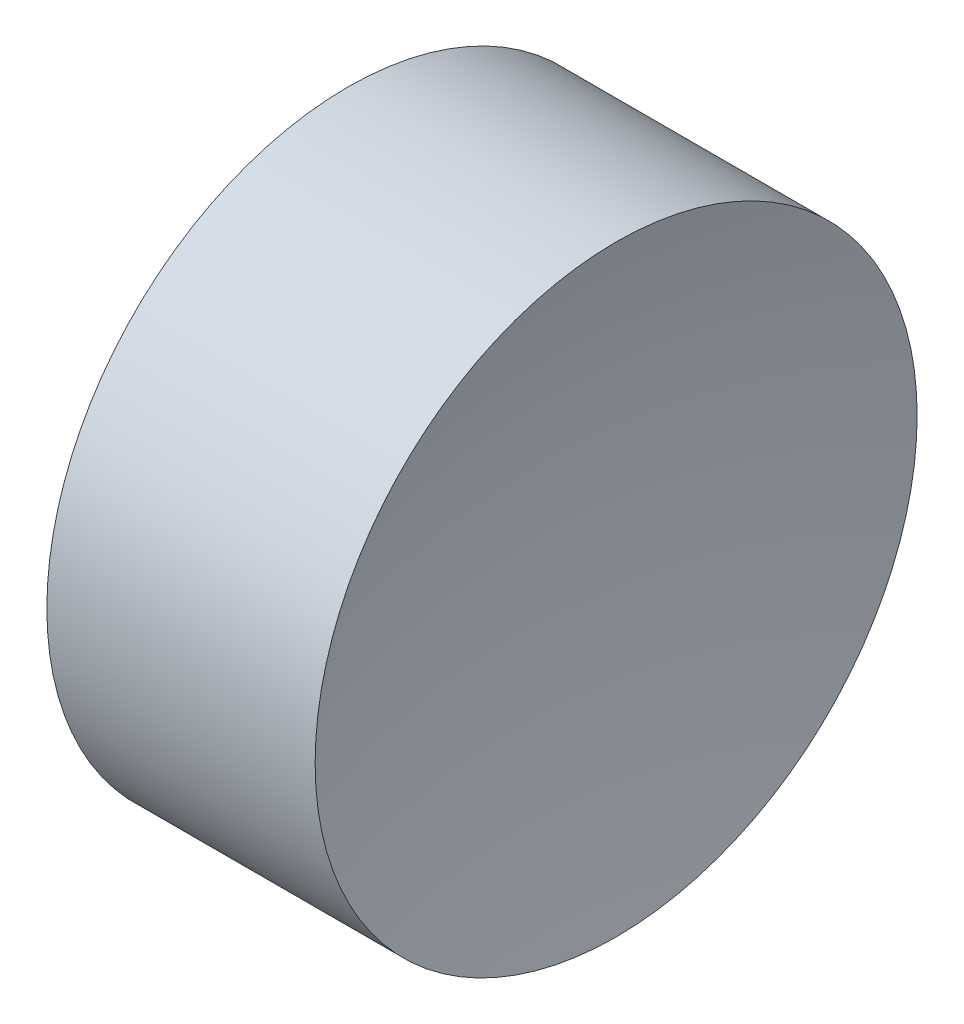
ISO-10303-21;
HEADER;
FILE_DESCRIPTION(('STEP AP214'),'2;1');
FILE_NAME('part.step','',(''),(''),'','','');
FILE_SCHEMA(('AUTOMOTIVE_DESIGN { 1 0 10303 214 1 1 1 1 }'));
ENDSEC;
DATA;
#1=APPLICATION_CONTEXT('core data for automotive mechanical design processes');
#2=APPLICATION_PROTOCOL_DEFINITION('international standard','automotive_design',2000,#1);
#3=PRODUCT_CONTEXT('',#1,'mechanical');
#4=PRODUCT('Part','Part','',(#3));
#5=PRODUCT_RELATED_PRODUCT_CATEGORY('part','',(#4));
#6=PRODUCT_DEFINITION_FORMATION('','',#4);
#7=PRODUCT_DEFINITION_CONTEXT('part definition',#1,'design');
#8=PRODUCT_DEFINITION('design','',#6,#7);
#9=PRODUCT_DEFINITION_SHAPE('','',#8);
#10=(LENGTH_UNIT() NAMED_UNIT(*) SI_UNIT(.MILLI.,.METRE.));
#11=(NAMED_UNIT(*) PLANE_ANGLE_UNIT() SI_UNIT($,.RADIAN.));
#12=(NAMED_UNIT(*) SI_UNIT($,.STERADIAN.) SOLID_ANGLE_UNIT());
#13=UNCERTAINTY_MEASURE_WITH_UNIT(LENGTH_MEASURE(1.E-05),#10,'distance_accuracy_value','');
#14=(GEOMETRIC_REPRESENTATION_CONTEXT(3) GLOBAL_UNCERTAINTY_ASSIGNED_CONTEXT((#13)) GLOBAL_UNIT_ASSIGNED_CONTEXT((#10,
#11,#12)) REPRESENTATION_CONTEXT('',''));
#15=CARTESIAN_POINT('',(0.,0.,0.));
#16=DIRECTION('',(0.,0.,1.));
#17=DIRECTION('',(1.,0.,0.));
#18=AXIS2_PLACEMENT_3D('',#15,#16,#17);
#19=CARTESIAN_POINT('',(19.1840859705899,6.52226028729874,0.0208644142968241));
#20=DIRECTION('',(0.,-1.,0.));
#21=DIRECTION('',(0.,0.,1.));
#22=AXIS2_PLACEMENT_3D('',#19,#20,#21);
#23=CIRCLE('',#22,6.67);
#24=TRIMMED_CURVE('',#23,(PARAMETER_VALUE(-1.5739244299918)),(PARAMETER_VALUE(1.5739244299918)),
.T.,.PARAMETER.);
#25=CARTESIAN_POINT('',(19.1840859705899,6.52226028729874,0.));
#26=DIRECTION('',(-1.,0.,0.));
#27=AXIS1_PLACEMENT('',#25,#26);
#28=SURFACE_OF_REVOLUTION('',#24,#27);
#29=CARTESIAN_POINT('',(12.6801596242121,6.52226028729874,0.));
#30=DIRECTION('',(-1.,0.,0.));
#31=DIRECTION('',(0.,0.,1.));
#32=AXIS2_PLACEMENT_3D('',#29,#30,#31);
#33=CIRCLE('',#32,1.5);
#34=CARTESIAN_POINT('',(12.6801596242121,6.52226028729874,1.5));
#35=VERTEX_POINT('',#34);
#36=EDGE_CURVE('E11',#35,#35,#33,.T.);
#37=ORIENTED_EDGE('',*,*,#36,.F.);
#38=EDGE_LOOP('',(#37));
#39=FACE_BOUND('',#38,.T.);
#40=CARTESIAN_POINT('',(12.514118603637,6.52226028729874,0.));
#41=VERTEX_POINT('',#40);
#42=VERTEX_LOOP('',#41);
#43=FACE_BOUND('',#42,.T.);
#44=ADVANCED_FACE('F37',(#39,#43),#28,.F.);
#45=CARTESIAN_POINT('',(10.6124652785342,6.52226028729874,0.));
#46=DIRECTION('',(-1.,0.,0.));
#47=DIRECTION('',(0.,0.,1.));
#48=AXIS2_PLACEMENT_3D('',#45,#46,#47);
#49=CYLINDRICAL_SURFACE('',#48,1.5);
#50=CARTESIAN_POINT('',(11.3432647013948,6.52226028729874,0.));
#51=DIRECTION('',(-1.,0.,0.));
#52=DIRECTION('',(0.,0.,1.));
#53=AXIS2_PLACEMENT_3D('',#50,#51,#52);
#54=CIRCLE('',#53,1.5);
#55=CARTESIAN_POINT('',(11.3432647013948,6.52226028729874,1.5));
#56=VERTEX_POINT('',#55);
#57=EDGE_CURVE('E43',#56,#56,#54,.T.);
#58=ORIENTED_EDGE('',*,*,#57,.F.);
#59=EDGE_LOOP('',(#58));
#60=FACE_BOUND('',#59,.T.);
#61=ORIENTED_EDGE('',*,*,#36,.T.);
#62=EDGE_LOOP('',(#61));
#63=FACE_BOUND('',#62,.T.);
#64=ADVANCED_FACE('F47',(#60,#63),#49,.T.);
#65=CARTESIAN_POINT('',(4.84411860363702,6.52226028729874,0.));
#66=DIRECTION('',(-1.,0.,0.));
#67=DIRECTION('',(0.,1.,0.));
#68=AXIS2_PLACEMENT_3D('',#65,#66,#67);
#69=SPHERICAL_SURFACE('',#68,6.67);
#70=ORIENTED_EDGE('',*,*,#57,.T.);
#71=EDGE_LOOP('',(#70));
#72=FACE_BOUND('',#71,.T.);
#73=ADVANCED_FACE('F52',(#72),#69,.F.);
#74=CLOSED_SHELL('',(#44,#64,#73));
#75=MANIFOLD_SOLID_BREP('B2',#74);
#76=ADVANCED_BREP_SHAPE_REPRESENTATION('',(#18,#75),#14);
#77=SHAPE_DEFINITION_REPRESENTATION(#9,#76);
ENDSEC;
END-ISO-10303-21;
